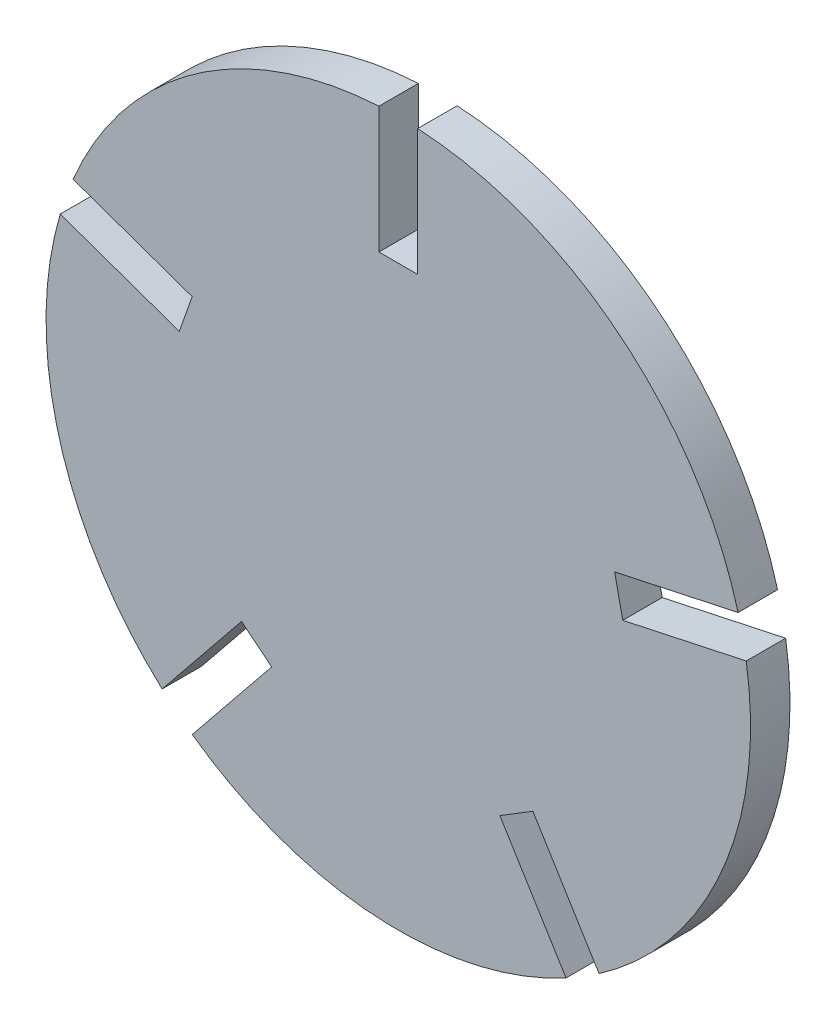
ISO-10303-21;
HEADER;
FILE_DESCRIPTION(('STEP AP214'),'2;1');
FILE_NAME('part.step','',(''),(''),'','','');
FILE_SCHEMA(('AUTOMOTIVE_DESIGN { 1 0 10303 214 1 1 1 1 }'));
ENDSEC;
DATA;
#1=APPLICATION_CONTEXT('core data for automotive mechanical design processes');
#2=APPLICATION_PROTOCOL_DEFINITION('international standard','automotive_design',2000,#1);
#3=PRODUCT_CONTEXT('',#1,'mechanical');
#4=PRODUCT('Part','Part','',(#3));
#5=PRODUCT_RELATED_PRODUCT_CATEGORY('part','',(#4));
#6=PRODUCT_DEFINITION_FORMATION('','',#4);
#7=PRODUCT_DEFINITION_CONTEXT('part definition',#1,'design');
#8=PRODUCT_DEFINITION('design','',#6,#7);
#9=PRODUCT_DEFINITION_SHAPE('','',#8);
#10=(LENGTH_UNIT() NAMED_UNIT(*) SI_UNIT(.MILLI.,.METRE.));
#11=(NAMED_UNIT(*) PLANE_ANGLE_UNIT() SI_UNIT($,.RADIAN.));
#12=(NAMED_UNIT(*) SI_UNIT($,.STERADIAN.) SOLID_ANGLE_UNIT());
#13=UNCERTAINTY_MEASURE_WITH_UNIT(LENGTH_MEASURE(1.E-05),#10,'distance_accuracy_value','');
#14=(GEOMETRIC_REPRESENTATION_CONTEXT(3) GLOBAL_UNCERTAINTY_ASSIGNED_CONTEXT((#13)) GLOBAL_UNIT_ASSIGNED_CONTEXT((#10,
#11,#12)) REPRESENTATION_CONTEXT('',''));
#15=CARTESIAN_POINT('',(0.,0.,0.));
#16=DIRECTION('',(0.,0.,1.));
#17=DIRECTION('',(1.,0.,0.));
#18=AXIS2_PLACEMENT_3D('',#15,#16,#17);
#19=CARTESIAN_POINT('',(0.,0.,2.8));
#20=DIRECTION('',(0.,0.,-1.));
#21=DIRECTION('',(-1.,0.,0.));
#22=AXIS2_PLACEMENT_3D('',#19,#20,#21);
#23=CYLINDRICAL_SURFACE('',#22,25.);
#24=DIRECTION('',(0.,0.,-1.));
#25=VECTOR('',#24,1.);
#26=CARTESIAN_POINT('',(24.694447311099,3.89670014234561,2.8));
#27=LINE('',#26,#25);
#28=CARTESIAN_POINT('',(24.694447311099,3.89670014234561,2.8));
#29=VERTEX_POINT('',#28);
#30=CARTESIAN_POINT('',(24.694447311099,3.89670014234561,0.));
#31=VERTEX_POINT('',#30);
#32=EDGE_CURVE('E264',#29,#31,#27,.T.);
#33=ORIENTED_EDGE('',*,*,#32,.F.);
#34=CARTESIAN_POINT('',(0.,0.,2.8));
#35=DIRECTION('',(0.,0.,1.));
#36=DIRECTION('',(1.,0.,0.));
#37=AXIS2_PLACEMENT_3D('',#34,#35,#36);
#38=CIRCLE('',#37,25.);
#39=CARTESIAN_POINT('',(14.2473587561517,-20.542949361606,2.8));
#40=VERTEX_POINT('',#39);
#41=EDGE_CURVE('E318',#40,#29,#38,.T.);
#42=ORIENTED_EDGE('',*,*,#41,.F.);
#43=DIRECTION('',(0.,0.,-1.));
#44=VECTOR('',#43,1.);
#45=CARTESIAN_POINT('',(14.2473587561517,-20.542949361606,2.8));
#46=LINE('',#45,#44);
#47=CARTESIAN_POINT('',(14.2473587561517,-20.542949361606,0.));
#48=VERTEX_POINT('',#47);
#49=EDGE_CURVE('E258',#48,#40,#46,.F.);
#50=ORIENTED_EDGE('',*,*,#49,.F.);
#51=CARTESIAN_POINT('',(0.,0.,0.));
#52=DIRECTION('',(0.,0.,1.));
#53=DIRECTION('',(1.,0.,0.));
#54=AXIS2_PLACEMENT_3D('',#51,#52,#53);
#55=CIRCLE('',#54,25.);
#56=EDGE_CURVE('E317',#48,#31,#55,.T.);
#57=ORIENTED_EDGE('',*,*,#56,.T.);
#58=EDGE_LOOP('',(#33,#42,#50,#57));
#59=FACE_BOUND('',#58,.T.);
#60=ADVANCED_FACE('F35',(#59),#23,.T.);
#61=DIRECTION('',(0.,0.,-1.));
#62=VECTOR('',#61,1.);
#63=CARTESIAN_POINT('',(24.117057693725,6.58540266024319,2.8));
#64=LINE('',#63,#62);
#65=CARTESIAN_POINT('',(24.117057693725,6.58540266024319,0.));
#66=VERTEX_POINT('',#65);
#67=CARTESIAN_POINT('',(24.117057693725,6.58540266024319,2.8));
#68=VERTEX_POINT('',#67);
#69=EDGE_CURVE('E262',#66,#68,#64,.F.);
#70=ORIENTED_EDGE('',*,*,#69,.F.);
#71=CARTESIAN_POINT('',(1.375,24.9621588609639,0.));
#72=VERTEX_POINT('',#71);
#73=EDGE_CURVE('E289',#66,#72,#55,.T.);
#74=ORIENTED_EDGE('',*,*,#73,.T.);
#75=DIRECTION('',(0.,0.,-1.));
#76=VECTOR('',#75,1.);
#77=CARTESIAN_POINT('',(1.375,24.9621588609639,2.8));
#78=LINE('',#77,#76);
#79=CARTESIAN_POINT('',(1.375,24.9621588609639,2.8));
#80=VERTEX_POINT('',#79);
#81=EDGE_CURVE('E286',#80,#72,#78,.T.);
#82=ORIENTED_EDGE('',*,*,#81,.F.);
#83=EDGE_CURVE('E295',#68,#80,#38,.T.);
#84=ORIENTED_EDGE('',*,*,#83,.F.);
#85=EDGE_LOOP('',(#70,#74,#82,#84));
#86=FACE_BOUND('',#85,.T.);
#87=ADVANCED_FACE('F326',(#86),#23,.T.);
#88=DIRECTION('',(0.,0.,-1.));
#89=VECTOR('',#88,1.);
#90=CARTESIAN_POINT('',(11.9048582277535,-21.9835017814972,2.8));
#91=LINE('',#90,#89);
#92=CARTESIAN_POINT('',(11.9048582277535,-21.9835017814972,2.8));
#93=VERTEX_POINT('',#92);
#94=CARTESIAN_POINT('',(11.9048582277535,-21.9835017814972,0.));
#95=VERTEX_POINT('',#94);
#96=EDGE_CURVE('E260',#93,#95,#91,.T.);
#97=ORIENTED_EDGE('',*,*,#96,.F.);
#98=CARTESIAN_POINT('',(-14.6193908611598,-20.2798769929366,2.8));
#99=VERTEX_POINT('',#98);
#100=EDGE_CURVE('E343',#99,#93,#38,.T.);
#101=ORIENTED_EDGE('',*,*,#100,.F.);
#102=DIRECTION('',(0.,0.,-1.));
#103=VECTOR('',#102,1.);
#104=CARTESIAN_POINT('',(-14.6193908611598,-20.2798769929366,2.8));
#105=LINE('',#104,#103);
#106=CARTESIAN_POINT('',(-14.6193908611598,-20.2798769929366,0.));
#107=VERTEX_POINT('',#106);
#108=EDGE_CURVE('E177',#107,#99,#105,.F.);
#109=ORIENTED_EDGE('',*,*,#108,.F.);
#110=EDGE_CURVE('E320',#107,#95,#55,.T.);
#111=ORIENTED_EDGE('',*,*,#110,.T.);
#112=EDGE_LOOP('',(#97,#101,#109,#111));
#113=FACE_BOUND('',#112,.T.);
#114=ADVANCED_FACE('F361',(#113),#23,.T.);
#115=DIRECTION('',(0.,0.,-1.));
#116=VECTOR('',#115,1.);
#117=CARTESIAN_POINT('',(-16.7583533956351,-18.5514848857714,2.8));
#118=LINE('',#117,#116);
#119=CARTESIAN_POINT('',(-16.7583533956351,-18.5514848857714,2.8));
#120=VERTEX_POINT('',#119);
#121=CARTESIAN_POINT('',(-16.7583533956351,-18.5514848857714,0.));
#122=VERTEX_POINT('',#121);
#123=EDGE_CURVE('E256',#120,#122,#118,.T.);
#124=ORIENTED_EDGE('',*,*,#123,.F.);
#125=CARTESIAN_POINT('',(-23.9930320469567,7.02384604000597,2.8));
#126=VERTEX_POINT('',#125);
#127=EDGE_CURVE('E294',#126,#120,#38,.T.);
#128=ORIENTED_EDGE('',*,*,#127,.F.);
#129=DIRECTION('',(0.,0.,-1.));
#130=VECTOR('',#129,1.);
#131=CARTESIAN_POINT('',(-23.9930320469567,7.02384604000597,2.8));
#132=LINE('',#131,#130);
#133=CARTESIAN_POINT('',(-23.9930320469567,7.02384604000597,0.));
#134=VERTEX_POINT('',#133);
#135=EDGE_CURVE('E251',#134,#126,#132,.F.);
#136=ORIENTED_EDGE('',*,*,#135,.F.);
#137=EDGE_CURVE('E299',#134,#122,#55,.T.);
#138=ORIENTED_EDGE('',*,*,#137,.T.);
#139=EDGE_LOOP('',(#124,#128,#136,#138));
#140=FACE_BOUND('',#139,.T.);
#141=ADVANCED_FACE('F352',(#140),#23,.T.);
#142=DIRECTION('',(0.,0.,-1.));
#143=VECTOR('',#142,1.);
#144=CARTESIAN_POINT('',(-23.0764206161441,9.61659043251819,2.8));
#145=LINE('',#144,#143);
#146=CARTESIAN_POINT('',(-23.0764206161441,9.61659043251819,2.8));
#147=VERTEX_POINT('',#146);
#148=CARTESIAN_POINT('',(-23.0764206161441,9.61659043251819,0.));
#149=VERTEX_POINT('',#148);
#150=EDGE_CURVE('E253',#147,#149,#145,.T.);
#151=ORIENTED_EDGE('',*,*,#150,.F.);
#152=CARTESIAN_POINT('',(-1.375,24.9621588609639,2.8));
#153=VERTEX_POINT('',#152);
#154=EDGE_CURVE('E290',#153,#147,#38,.T.);
#155=ORIENTED_EDGE('',*,*,#154,.F.);
#156=DIRECTION('',(0.,0.,-1.));
#157=VECTOR('',#156,1.);
#158=CARTESIAN_POINT('',(-1.375,24.9621588609639,2.8));
#159=LINE('',#158,#157);
#160=CARTESIAN_POINT('',(-1.375,24.9621588609639,0.));
#161=VERTEX_POINT('',#160);
#162=EDGE_CURVE('E284',#161,#153,#159,.F.);
#163=ORIENTED_EDGE('',*,*,#162,.F.);
#164=EDGE_CURVE('E296',#161,#149,#55,.T.);
#165=ORIENTED_EDGE('',*,*,#164,.T.);
#166=EDGE_LOOP('',(#151,#155,#163,#165));
#167=FACE_BOUND('',#166,.T.);
#168=ADVANCED_FACE('F378',(#167),#23,.T.);
#169=CARTESIAN_POINT('',(0.,0.,2.8));
#170=DIRECTION('',(0.,0.,1.));
#171=DIRECTION('',(1.,0.,0.));
#172=AXIS2_PLACEMENT_3D('',#169,#170,#171);
#173=PLANE('',#172);
#174=ORIENTED_EDGE('',*,*,#41,.T.);
#175=DIRECTION('',(0.97771000650821,0.209959860863253,0.));
#176=VECTOR('',#175,1.);
#177=CARTESIAN_POINT('',(33.5308350299661,5.79428401040181,2.8));
#178=LINE('',#177,#176);
#179=CARTESIAN_POINT('',(15.9320549128183,2.01500651486326,2.8));
#180=VERTEX_POINT('',#179);
#181=EDGE_CURVE('E222',#180,#29,#178,.T.);
#182=ORIENTED_EDGE('',*,*,#181,.F.);
#183=DIRECTION('',(0.209959860863253,-0.97771000650821,0.));
#184=VECTOR('',#183,1.);
#185=CARTESIAN_POINT('',(15.3546652954444,4.70370903276083,2.8));
#186=LINE('',#185,#184);
#187=CARTESIAN_POINT('',(15.3546652954444,4.70370903276083,2.8));
#188=VERTEX_POINT('',#187);
#189=EDGE_CURVE('E227',#188,#180,#186,.T.);
#190=ORIENTED_EDGE('',*,*,#189,.F.);
#191=DIRECTION('',(-0.97771000650821,-0.209959860863253,0.));
#192=VECTOR('',#191,1.);
#193=CARTESIAN_POINT('',(32.9534454125922,8.48298652829939,2.8));
#194=LINE('',#193,#192);
#195=EDGE_CURVE('E224',#68,#188,#194,.T.);
#196=ORIENTED_EDGE('',*,*,#195,.F.);
#197=ORIENTED_EDGE('',*,*,#83,.T.);
#198=DIRECTION('',(0.,1.,0.));
#199=VECTOR('',#198,1.);
#200=CARTESIAN_POINT('',(1.375,34.,2.8));
#201=LINE('',#200,#199);
#202=CARTESIAN_POINT('',(1.375,16.,2.8));
#203=VERTEX_POINT('',#202);
#204=EDGE_CURVE('E267',#203,#80,#201,.T.);
#205=ORIENTED_EDGE('',*,*,#204,.F.);
#206=DIRECTION('',(1.,0.,0.));
#207=VECTOR('',#206,1.);
#208=CARTESIAN_POINT('',(-1.375,16.,2.8));
#209=LINE('',#208,#207);
#210=CARTESIAN_POINT('',(-1.375,16.,2.8));
#211=VERTEX_POINT('',#210);
#212=EDGE_CURVE('E273',#211,#203,#209,.T.);
#213=ORIENTED_EDGE('',*,*,#212,.F.);
#214=DIRECTION('',(0.,-1.,0.));
#215=VECTOR('',#214,1.);
#216=CARTESIAN_POINT('',(-1.375,34.,2.8));
#217=LINE('',#216,#215);
#218=EDGE_CURVE('E270',#153,#211,#217,.T.);
#219=ORIENTED_EDGE('',*,*,#218,.F.);
#220=ORIENTED_EDGE('',*,*,#154,.T.);
#221=DIRECTION('',(-0.942816142731719,0.333313247568235,0.));
#222=VECTOR('',#221,1.);
#223=CARTESIAN_POINT('',(-31.5974431374721,12.6290226135761,2.8));
#224=LINE('',#223,#222);
#225=CARTESIAN_POINT('',(-14.6267525683012,6.62938415734787,2.8));
#226=VERTEX_POINT('',#225);
#227=EDGE_CURVE('E235',#226,#147,#224,.T.);
#228=ORIENTED_EDGE('',*,*,#227,.F.);
#229=DIRECTION('',(0.333313247568235,0.942816142731719,0.));
#230=VECTOR('',#229,1.);
#231=CARTESIAN_POINT('',(-15.5433639991138,4.03663976483565,2.8));
#232=LINE('',#231,#230);
#233=CARTESIAN_POINT('',(-15.5433639991138,4.03663976483565,2.8));
#234=VERTEX_POINT('',#233);
#235=EDGE_CURVE('E240',#234,#226,#232,.T.);
#236=ORIENTED_EDGE('',*,*,#235,.F.);
#237=DIRECTION('',(0.942816142731719,-0.333313247568235,0.));
#238=VECTOR('',#237,1.);
#239=CARTESIAN_POINT('',(-32.5140545682848,10.0362782210639,2.8));
#240=LINE('',#239,#238);
#241=EDGE_CURVE('E237',#126,#234,#240,.T.);
#242=ORIENTED_EDGE('',*,*,#241,.F.);
#243=ORIENTED_EDGE('',*,*,#127,.T.);
#244=DIRECTION('',(-0.628506220787331,-0.777804557991033,0.));
#245=VECTOR('',#244,1.);
#246=CARTESIAN_POINT('',(-22.4386927740069,-25.5811589181125,2.8));
#247=LINE('',#246,#245);
#248=CARTESIAN_POINT('',(-11.125580799835,-11.5806768742739,2.8));
#249=VERTEX_POINT('',#248);
#250=EDGE_CURVE('E183',#249,#120,#247,.T.);
#251=ORIENTED_EDGE('',*,*,#250,.F.);
#252=DIRECTION('',(-0.777804557991033,0.628506220787331,0.));
#253=VECTOR('',#252,1.);
#254=CARTESIAN_POINT('',(-8.98661826535963,-13.3090689814391,2.8));
#255=LINE('',#254,#253);
#256=CARTESIAN_POINT('',(-8.98661826535963,-13.3090689814391,2.8));
#257=VERTEX_POINT('',#256);
#258=EDGE_CURVE('E182',#257,#249,#255,.T.);
#259=ORIENTED_EDGE('',*,*,#258,.F.);
#260=DIRECTION('',(0.628506220787331,0.777804557991033,0.));
#261=VECTOR('',#260,1.);
#262=CARTESIAN_POINT('',(-20.2997302395316,-27.3095510252777,2.8));
#263=LINE('',#262,#261);
#264=EDGE_CURVE('E171',#99,#257,#263,.T.);
#265=ORIENTED_EDGE('',*,*,#264,.F.);
#266=ORIENTED_EDGE('',*,*,#100,.T.);
#267=DIRECTION('',(0.523837243596792,-0.851818373962968,0.));
#268=VECTOR('',#267,1.);
#269=CARTESIAN_POINT('',(16.6392160180919,-29.6821009246865,2.8));
#270=LINE('',#269,#268);
#271=CARTESIAN_POINT('',(7.21014563334959,-14.3493701933531,2.8));
#272=VERTEX_POINT('',#271);
#273=EDGE_CURVE('E208',#272,#93,#270,.T.);
#274=ORIENTED_EDGE('',*,*,#273,.F.);
#275=DIRECTION('',(-0.851818373962968,-0.523837243596792,0.));
#276=VECTOR('',#275,1.);
#277=CARTESIAN_POINT('',(9.55264616174776,-12.9088177734619,2.8));
#278=LINE('',#277,#276);
#279=CARTESIAN_POINT('',(9.55264616174776,-12.9088177734619,2.8));
#280=VERTEX_POINT('',#279);
#281=EDGE_CURVE('E213',#280,#272,#278,.T.);
#282=ORIENTED_EDGE('',*,*,#281,.F.);
#283=DIRECTION('',(-0.523837243596792,0.851818373962968,0.));
#284=VECTOR('',#283,1.);
#285=CARTESIAN_POINT('',(18.98171654649,-28.2415485047953,2.8));
#286=LINE('',#285,#284);
#287=EDGE_CURVE('E210',#40,#280,#286,.T.);
#288=ORIENTED_EDGE('',*,*,#287,.F.);
#289=EDGE_LOOP('',(#174,#182,#190,#196,#197,#205,#213,#219,#220,#228,#236,#242,#243,#251,#259,
#265,#266,#274,#282,#288));
#290=FACE_BOUND('',#289,.T.);
#291=ADVANCED_FACE('F197',(#290),#173,.T.);
#292=CARTESIAN_POINT('',(0.,0.,0.));
#293=DIRECTION('',(0.,0.,1.));
#294=DIRECTION('',(1.,0.,0.));
#295=AXIS2_PLACEMENT_3D('',#292,#293,#294);
#296=PLANE('',#295);
#297=DIRECTION('',(0.97771000650821,0.209959860863253,0.));
#298=VECTOR('',#297,1.);
#299=CARTESIAN_POINT('',(33.5308350299661,5.79428401040181,0.));
#300=LINE('',#299,#298);
#301=CARTESIAN_POINT('',(15.9320549128183,2.01500651486326,0.));
#302=VERTEX_POINT('',#301);
#303=EDGE_CURVE('E49',#302,#31,#300,.T.);
#304=ORIENTED_EDGE('',*,*,#303,.T.);
#305=ORIENTED_EDGE('',*,*,#56,.F.);
#306=DIRECTION('',(0.523837243596792,-0.851818373962968,0.));
#307=VECTOR('',#306,1.);
#308=CARTESIAN_POINT('',(1.17125026419907,0.720276209945585,0.));
#309=LINE('',#308,#307);
#310=CARTESIAN_POINT('',(9.55264616174776,-12.9088177734619,0.));
#311=VERTEX_POINT('',#310);
#312=EDGE_CURVE('E42',#311,#48,#309,.T.);
#313=ORIENTED_EDGE('',*,*,#312,.F.);
#314=DIRECTION('',(-0.851818373962968,-0.523837243596792,0.));
#315=VECTOR('',#314,1.);
#316=CARTESIAN_POINT('',(9.55264616174776,-12.9088177734619,0.));
#317=LINE('',#316,#315);
#318=CARTESIAN_POINT('',(7.21014563334959,-14.3493701933531,0.));
#319=VERTEX_POINT('',#318);
#320=EDGE_CURVE('E211',#311,#319,#317,.T.);
#321=ORIENTED_EDGE('',*,*,#320,.T.);
#322=DIRECTION('',(0.523837243596792,-0.851818373962968,0.));
#323=VECTOR('',#322,1.);
#324=CARTESIAN_POINT('',(16.6392160180919,-29.6821009246865,0.));
#325=LINE('',#324,#323);
#326=EDGE_CURVE('E57',#319,#95,#325,.T.);
#327=ORIENTED_EDGE('',*,*,#326,.T.);
#328=ORIENTED_EDGE('',*,*,#110,.F.);
#329=DIRECTION('',(-0.628506220787331,-0.777804557991033,0.));
#330=VECTOR('',#329,1.);
#331=CARTESIAN_POINT('',(1.06948126723766,-0.864196053582575,0.));
#332=LINE('',#331,#330);
#333=CARTESIAN_POINT('',(-8.98661826535963,-13.3090689814391,0.));
#334=VERTEX_POINT('',#333);
#335=EDGE_CURVE('E303',#334,#107,#332,.T.);
#336=ORIENTED_EDGE('',*,*,#335,.F.);
#337=DIRECTION('',(-0.777804557991033,0.628506220787331,0.));
#338=VECTOR('',#337,1.);
#339=CARTESIAN_POINT('',(-8.98661826535963,-13.3090689814391,0.));
#340=LINE('',#339,#338);
#341=CARTESIAN_POINT('',(-11.125580799835,-11.580676874274,0.));
#342=VERTEX_POINT('',#341);
#343=EDGE_CURVE('E190',#334,#342,#340,.T.);
#344=ORIENTED_EDGE('',*,*,#343,.T.);
#345=DIRECTION('',(-0.628506220787331,-0.777804557991033,0.));
#346=VECTOR('',#345,1.);
#347=CARTESIAN_POINT('',(-22.4386927740069,-25.5811589181125,0.));
#348=LINE('',#347,#346);
#349=EDGE_CURVE('E203',#342,#122,#348,.T.);
#350=ORIENTED_EDGE('',*,*,#349,.T.);
#351=ORIENTED_EDGE('',*,*,#137,.F.);
#352=DIRECTION('',(-0.942816142731719,0.333313247568235,0.));
#353=VECTOR('',#352,1.);
#354=CARTESIAN_POINT('',(-0.458305715406322,-1.29637219625611,0.));
#355=LINE('',#354,#353);
#356=CARTESIAN_POINT('',(-15.5433639991138,4.03663976483565,0.));
#357=VERTEX_POINT('',#356);
#358=EDGE_CURVE('E301',#357,#134,#355,.T.);
#359=ORIENTED_EDGE('',*,*,#358,.F.);
#360=DIRECTION('',(0.333313247568235,0.942816142731719,0.));
#361=VECTOR('',#360,1.);
#362=CARTESIAN_POINT('',(-15.5433639991138,4.03663976483565,0.));
#363=LINE('',#362,#361);
#364=CARTESIAN_POINT('',(-14.6267525683012,6.62938415734787,0.));
#365=VERTEX_POINT('',#364);
#366=EDGE_CURVE('E238',#357,#365,#363,.T.);
#367=ORIENTED_EDGE('',*,*,#366,.T.);
#368=DIRECTION('',(-0.942816142731719,0.333313247568235,0.));
#369=VECTOR('',#368,1.);
#370=CARTESIAN_POINT('',(-31.5974431374721,12.6290226135761,0.));
#371=LINE('',#370,#369);
#372=EDGE_CURVE('E192',#365,#149,#371,.T.);
#373=ORIENTED_EDGE('',*,*,#372,.T.);
#374=ORIENTED_EDGE('',*,*,#164,.F.);
#375=DIRECTION('',(0.,1.,0.));
#376=VECTOR('',#375,1.);
#377=CARTESIAN_POINT('',(-1.375,0.,0.));
#378=LINE('',#377,#376);
#379=CARTESIAN_POINT('',(-1.375,16.,0.));
#380=VERTEX_POINT('',#379);
#381=EDGE_CURVE('E293',#380,#161,#378,.T.);
#382=ORIENTED_EDGE('',*,*,#381,.F.);
#383=DIRECTION('',(1.,0.,0.));
#384=VECTOR('',#383,1.);
#385=CARTESIAN_POINT('',(-1.375,16.,0.));
#386=LINE('',#385,#384);
#387=CARTESIAN_POINT('',(1.375,16.,0.));
#388=VERTEX_POINT('',#387);
#389=EDGE_CURVE('E271',#380,#388,#386,.T.);
#390=ORIENTED_EDGE('',*,*,#389,.T.);
#391=DIRECTION('',(0.,1.,0.));
#392=VECTOR('',#391,1.);
#393=CARTESIAN_POINT('',(1.375,34.,0.));
#394=LINE('',#393,#392);
#395=EDGE_CURVE('E266',#388,#72,#394,.T.);
#396=ORIENTED_EDGE('',*,*,#395,.T.);
#397=ORIENTED_EDGE('',*,*,#73,.F.);
#398=DIRECTION('',(0.97771000650821,0.209959860863253,0.));
#399=VECTOR('',#398,1.);
#400=CARTESIAN_POINT('',(-0.288694808686972,1.34435125894878,0.));
#401=LINE('',#400,#399);
#402=CARTESIAN_POINT('',(15.3546652954444,4.70370903276083,0.));
#403=VERTEX_POINT('',#402);
#404=EDGE_CURVE('E11',#403,#66,#401,.T.);
#405=ORIENTED_EDGE('',*,*,#404,.F.);
#406=DIRECTION('',(0.209959860863253,-0.97771000650821,0.));
#407=VECTOR('',#406,1.);
#408=CARTESIAN_POINT('',(15.3546652954444,4.70370903276083,0.));
#409=LINE('',#408,#407);
#410=EDGE_CURVE('E225',#403,#302,#409,.T.);
#411=ORIENTED_EDGE('',*,*,#410,.T.);
#412=EDGE_LOOP('',(#304,#305,#313,#321,#327,#328,#336,#344,#350,#351,#359,#367,#373,#374,#382,
#390,#396,#397,#405,#411));
#413=FACE_BOUND('',#412,.T.);
#414=ADVANCED_FACE('F319',(#413),#296,.F.);
#415=CARTESIAN_POINT('',(1.375,34.,2.8));
#416=DIRECTION('',(-1.,0.,0.));
#417=DIRECTION('',(0.,-1.,0.));
#418=AXIS2_PLACEMENT_3D('',#415,#416,#417);
#419=PLANE('',#418);
#420=ORIENTED_EDGE('',*,*,#81,.T.);
#421=ORIENTED_EDGE('',*,*,#395,.F.);
#422=DIRECTION('',(0.,0.,-1.));
#423=VECTOR('',#422,1.);
#424=CARTESIAN_POINT('',(1.375,16.,2.8));
#425=LINE('',#424,#423);
#426=EDGE_CURVE('E275',#203,#388,#425,.T.);
#427=ORIENTED_EDGE('',*,*,#426,.F.);
#428=ORIENTED_EDGE('',*,*,#204,.T.);
#429=EDGE_LOOP('',(#420,#421,#427,#428));
#430=FACE_BOUND('',#429,.T.);
#431=ADVANCED_FACE('F330',(#430),#419,.T.);
#432=CARTESIAN_POINT('',(-1.375,34.,2.8));
#433=DIRECTION('',(1.,0.,0.));
#434=DIRECTION('',(0.,1.,0.));
#435=AXIS2_PLACEMENT_3D('',#432,#433,#434);
#436=PLANE('',#435);
#437=ORIENTED_EDGE('',*,*,#162,.T.);
#438=ORIENTED_EDGE('',*,*,#218,.T.);
#439=DIRECTION('',(0.,0.,-1.));
#440=VECTOR('',#439,1.);
#441=CARTESIAN_POINT('',(-1.375,16.,2.8));
#442=LINE('',#441,#440);
#443=EDGE_CURVE('E282',#211,#380,#442,.T.);
#444=ORIENTED_EDGE('',*,*,#443,.T.);
#445=ORIENTED_EDGE('',*,*,#381,.T.);
#446=EDGE_LOOP('',(#437,#438,#444,#445));
#447=FACE_BOUND('',#446,.T.);
#448=ADVANCED_FACE('F395',(#447),#436,.T.);
#449=CARTESIAN_POINT('',(-1.375,16.,2.8));
#450=DIRECTION('',(0.,1.,0.));
#451=DIRECTION('',(0.,0.,1.));
#452=AXIS2_PLACEMENT_3D('',#449,#450,#451);
#453=PLANE('',#452);
#454=ORIENTED_EDGE('',*,*,#389,.F.);
#455=ORIENTED_EDGE('',*,*,#443,.F.);
#456=ORIENTED_EDGE('',*,*,#212,.T.);
#457=ORIENTED_EDGE('',*,*,#426,.T.);
#458=EDGE_LOOP('',(#454,#455,#456,#457));
#459=FACE_BOUND('',#458,.T.);
#460=ADVANCED_FACE('F338',(#459),#453,.T.);
#461=CARTESIAN_POINT('',(-31.5974431374721,12.6290226135761,2.8));
#462=DIRECTION('',(-0.333313247568235,-0.942816142731719,0.));
#463=DIRECTION('',(0.942816142731719,-0.333313247568235,0.));
#464=AXIS2_PLACEMENT_3D('',#461,#462,#463);
#465=PLANE('',#464);
#466=ORIENTED_EDGE('',*,*,#150,.T.);
#467=ORIENTED_EDGE('',*,*,#372,.F.);
#468=DIRECTION('',(0.,0.,-1.));
#469=VECTOR('',#468,1.);
#470=CARTESIAN_POINT('',(-14.6267525683012,6.62938415734787,2.8));
#471=LINE('',#470,#469);
#472=EDGE_CURVE('E242',#226,#365,#471,.T.);
#473=ORIENTED_EDGE('',*,*,#472,.F.);
#474=ORIENTED_EDGE('',*,*,#227,.T.);
#475=EDGE_LOOP('',(#466,#467,#473,#474));
#476=FACE_BOUND('',#475,.T.);
#477=ADVANCED_FACE('F398',(#476),#465,.T.);
#478=CARTESIAN_POINT('',(-32.5140545682848,10.0362782210639,2.8));
#479=DIRECTION('',(0.333313247568235,0.942816142731719,0.));
#480=DIRECTION('',(-0.942816142731719,0.333313247568235,0.));
#481=AXIS2_PLACEMENT_3D('',#478,#479,#480);
#482=PLANE('',#481);
#483=ORIENTED_EDGE('',*,*,#135,.T.);
#484=ORIENTED_EDGE('',*,*,#241,.T.);
#485=DIRECTION('',(0.,0.,-1.));
#486=VECTOR('',#485,1.);
#487=CARTESIAN_POINT('',(-15.5433639991138,4.03663976483565,2.8));
#488=LINE('',#487,#486);
#489=EDGE_CURVE('E249',#234,#357,#488,.T.);
#490=ORIENTED_EDGE('',*,*,#489,.T.);
#491=ORIENTED_EDGE('',*,*,#358,.T.);
#492=EDGE_LOOP('',(#483,#484,#490,#491));
#493=FACE_BOUND('',#492,.T.);
#494=ADVANCED_FACE('F403',(#493),#482,.T.);
#495=CARTESIAN_POINT('',(-15.5433639991138,4.03663976483565,2.8));
#496=DIRECTION('',(-0.942816142731719,0.333313247568235,0.));
#497=DIRECTION('',(-0.333313247568235,-0.942816142731719,0.));
#498=AXIS2_PLACEMENT_3D('',#495,#496,#497);
#499=PLANE('',#498);
#500=ORIENTED_EDGE('',*,*,#366,.F.);
#501=ORIENTED_EDGE('',*,*,#489,.F.);
#502=ORIENTED_EDGE('',*,*,#235,.T.);
#503=ORIENTED_EDGE('',*,*,#472,.T.);
#504=EDGE_LOOP('',(#500,#501,#502,#503));
#505=FACE_BOUND('',#504,.T.);
#506=ADVANCED_FACE('F400',(#505),#499,.T.);
#507=CARTESIAN_POINT('',(-22.4386927740069,-25.5811589181125,2.8));
#508=DIRECTION('',(0.777804557991033,-0.628506220787331,0.));
#509=DIRECTION('',(0.628506220787331,0.777804557991033,0.));
#510=AXIS2_PLACEMENT_3D('',#507,#508,#509);
#511=PLANE('',#510);
#512=ORIENTED_EDGE('',*,*,#123,.T.);
#513=ORIENTED_EDGE('',*,*,#349,.F.);
#514=DIRECTION('',(0.,0.,-1.));
#515=VECTOR('',#514,1.);
#516=CARTESIAN_POINT('',(-11.125580799835,-11.5806768742739,2.8));
#517=LINE('',#516,#515);
#518=EDGE_CURVE('E193',#249,#342,#517,.T.);
#519=ORIENTED_EDGE('',*,*,#518,.F.);
#520=ORIENTED_EDGE('',*,*,#250,.T.);
#521=EDGE_LOOP('',(#512,#513,#519,#520));
#522=FACE_BOUND('',#521,.T.);
#523=ADVANCED_FACE('F356',(#522),#511,.T.);
#524=CARTESIAN_POINT('',(-20.2997302395316,-27.3095510252777,2.8));
#525=DIRECTION('',(-0.777804557991033,0.628506220787331,0.));
#526=DIRECTION('',(-0.628506220787331,-0.777804557991033,0.));
#527=AXIS2_PLACEMENT_3D('',#524,#525,#526);
#528=PLANE('',#527);
#529=ORIENTED_EDGE('',*,*,#108,.T.);
#530=ORIENTED_EDGE('',*,*,#264,.T.);
#531=DIRECTION('',(0.,0.,-1.));
#532=VECTOR('',#531,1.);
#533=CARTESIAN_POINT('',(-8.98661826535963,-13.3090689814391,2.8));
#534=LINE('',#533,#532);
#535=EDGE_CURVE('E174',#257,#334,#534,.T.);
#536=ORIENTED_EDGE('',*,*,#535,.T.);
#537=ORIENTED_EDGE('',*,*,#335,.T.);
#538=EDGE_LOOP('',(#529,#530,#536,#537));
#539=FACE_BOUND('',#538,.T.);
#540=ADVANCED_FACE('F173',(#539),#528,.T.);
#541=CARTESIAN_POINT('',(-8.98661826535963,-13.3090689814391,2.8));
#542=DIRECTION('',(-0.628506220787331,-0.777804557991033,0.));
#543=DIRECTION('',(0.777804557991033,-0.628506220787331,0.));
#544=AXIS2_PLACEMENT_3D('',#541,#542,#543);
#545=PLANE('',#544);
#546=ORIENTED_EDGE('',*,*,#343,.F.);
#547=ORIENTED_EDGE('',*,*,#535,.F.);
#548=ORIENTED_EDGE('',*,*,#258,.T.);
#549=ORIENTED_EDGE('',*,*,#518,.T.);
#550=EDGE_LOOP('',(#546,#547,#548,#549));
#551=FACE_BOUND('',#550,.T.);
#552=ADVANCED_FACE('F186',(#551),#545,.T.);
#553=CARTESIAN_POINT('',(16.6392160180919,-29.6821009246865,2.8));
#554=DIRECTION('',(0.851818373962968,0.523837243596792,0.));
#555=DIRECTION('',(-0.523837243596792,0.851818373962968,0.));
#556=AXIS2_PLACEMENT_3D('',#553,#554,#555);
#557=PLANE('',#556);
#558=ORIENTED_EDGE('',*,*,#96,.T.);
#559=ORIENTED_EDGE('',*,*,#326,.F.);
#560=DIRECTION('',(0.,0.,-1.));
#561=VECTOR('',#560,1.);
#562=CARTESIAN_POINT('',(7.21014563334959,-14.3493701933531,2.8));
#563=LINE('',#562,#561);
#564=EDGE_CURVE('E215',#272,#319,#563,.T.);
#565=ORIENTED_EDGE('',*,*,#564,.F.);
#566=ORIENTED_EDGE('',*,*,#273,.T.);
#567=EDGE_LOOP('',(#558,#559,#565,#566));
#568=FACE_BOUND('',#567,.T.);
#569=ADVANCED_FACE('F362',(#568),#557,.T.);
#570=CARTESIAN_POINT('',(18.98171654649,-28.2415485047953,2.8));
#571=DIRECTION('',(-0.851818373962968,-0.523837243596792,0.));
#572=DIRECTION('',(0.523837243596792,-0.851818373962968,0.));
#573=AXIS2_PLACEMENT_3D('',#570,#571,#572);
#574=PLANE('',#573);
#575=ORIENTED_EDGE('',*,*,#49,.T.);
#576=ORIENTED_EDGE('',*,*,#287,.T.);
#577=DIRECTION('',(0.,0.,-1.));
#578=VECTOR('',#577,1.);
#579=CARTESIAN_POINT('',(9.55264616174776,-12.9088177734619,2.8));
#580=LINE('',#579,#578);
#581=EDGE_CURVE('E206',#280,#311,#580,.T.);
#582=ORIENTED_EDGE('',*,*,#581,.T.);
#583=ORIENTED_EDGE('',*,*,#312,.T.);
#584=EDGE_LOOP('',(#575,#576,#582,#583));
#585=FACE_BOUND('',#584,.T.);
#586=ADVANCED_FACE('F307',(#585),#574,.T.);
#587=CARTESIAN_POINT('',(9.55264616174776,-12.9088177734619,2.8));
#588=DIRECTION('',(0.523837243596792,-0.851818373962968,0.));
#589=DIRECTION('',(0.851818373962968,0.523837243596792,0.));
#590=AXIS2_PLACEMENT_3D('',#587,#588,#589);
#591=PLANE('',#590);
#592=ORIENTED_EDGE('',*,*,#320,.F.);
#593=ORIENTED_EDGE('',*,*,#581,.F.);
#594=ORIENTED_EDGE('',*,*,#281,.T.);
#595=ORIENTED_EDGE('',*,*,#564,.T.);
#596=EDGE_LOOP('',(#592,#593,#594,#595));
#597=FACE_BOUND('',#596,.T.);
#598=ADVANCED_FACE('F364',(#597),#591,.T.);
#599=CARTESIAN_POINT('',(33.5308350299661,5.79428401040181,2.8));
#600=DIRECTION('',(-0.209959860863253,0.97771000650821,0.));
#601=DIRECTION('',(-0.97771000650821,-0.209959860863253,0.));
#602=AXIS2_PLACEMENT_3D('',#599,#600,#601);
#603=PLANE('',#602);
#604=ORIENTED_EDGE('',*,*,#32,.T.);
#605=ORIENTED_EDGE('',*,*,#303,.F.);
#606=DIRECTION('',(0.,0.,-1.));
#607=VECTOR('',#606,1.);
#608=CARTESIAN_POINT('',(15.9320549128183,2.01500651486326,2.8));
#609=LINE('',#608,#607);
#610=EDGE_CURVE('E229',#180,#302,#609,.T.);
#611=ORIENTED_EDGE('',*,*,#610,.F.);
#612=ORIENTED_EDGE('',*,*,#181,.T.);
#613=EDGE_LOOP('',(#604,#605,#611,#612));
#614=FACE_BOUND('',#613,.T.);
#615=ADVANCED_FACE('F367',(#614),#603,.T.);
#616=CARTESIAN_POINT('',(32.9534454125922,8.48298652829939,2.8));
#617=DIRECTION('',(0.209959860863253,-0.97771000650821,0.));
#618=DIRECTION('',(0.97771000650821,0.209959860863253,0.));
#619=AXIS2_PLACEMENT_3D('',#616,#617,#618);
#620=PLANE('',#619);
#621=ORIENTED_EDGE('',*,*,#69,.T.);
#622=ORIENTED_EDGE('',*,*,#195,.T.);
#623=DIRECTION('',(0.,0.,-1.));
#624=VECTOR('',#623,1.);
#625=CARTESIAN_POINT('',(15.3546652954444,4.70370903276083,2.8));
#626=LINE('',#625,#624);
#627=EDGE_CURVE('E217',#188,#403,#626,.T.);
#628=ORIENTED_EDGE('',*,*,#627,.T.);
#629=ORIENTED_EDGE('',*,*,#404,.T.);
#630=EDGE_LOOP('',(#621,#622,#628,#629));
#631=FACE_BOUND('',#630,.T.);
#632=ADVANCED_FACE('F373',(#631),#620,.T.);
#633=CARTESIAN_POINT('',(15.3546652954444,4.70370903276083,2.8));
#634=DIRECTION('',(0.97771000650821,0.209959860863253,0.));
#635=DIRECTION('',(-0.209959860863253,0.97771000650821,0.));
#636=AXIS2_PLACEMENT_3D('',#633,#634,#635);
#637=PLANE('',#636);
#638=ORIENTED_EDGE('',*,*,#410,.F.);
#639=ORIENTED_EDGE('',*,*,#627,.F.);
#640=ORIENTED_EDGE('',*,*,#189,.T.);
#641=ORIENTED_EDGE('',*,*,#610,.T.);
#642=EDGE_LOOP('',(#638,#639,#640,#641));
#643=FACE_BOUND('',#642,.T.);
#644=ADVANCED_FACE('F506',(#643),#637,.T.);
#645=CLOSED_SHELL('',(#60,#87,#114,#141,#168,#291,#414,#431,#448,#460,#477,#494,#506,#523,#540,
#552,#569,#586,#598,#615,#632,#644));
#646=MANIFOLD_SOLID_BREP('B2',#645);
#647=ADVANCED_BREP_SHAPE_REPRESENTATION('',(#18,#646),#14);
#648=SHAPE_DEFINITION_REPRESENTATION(#9,#647);
ENDSEC;
END-ISO-10303-21;
